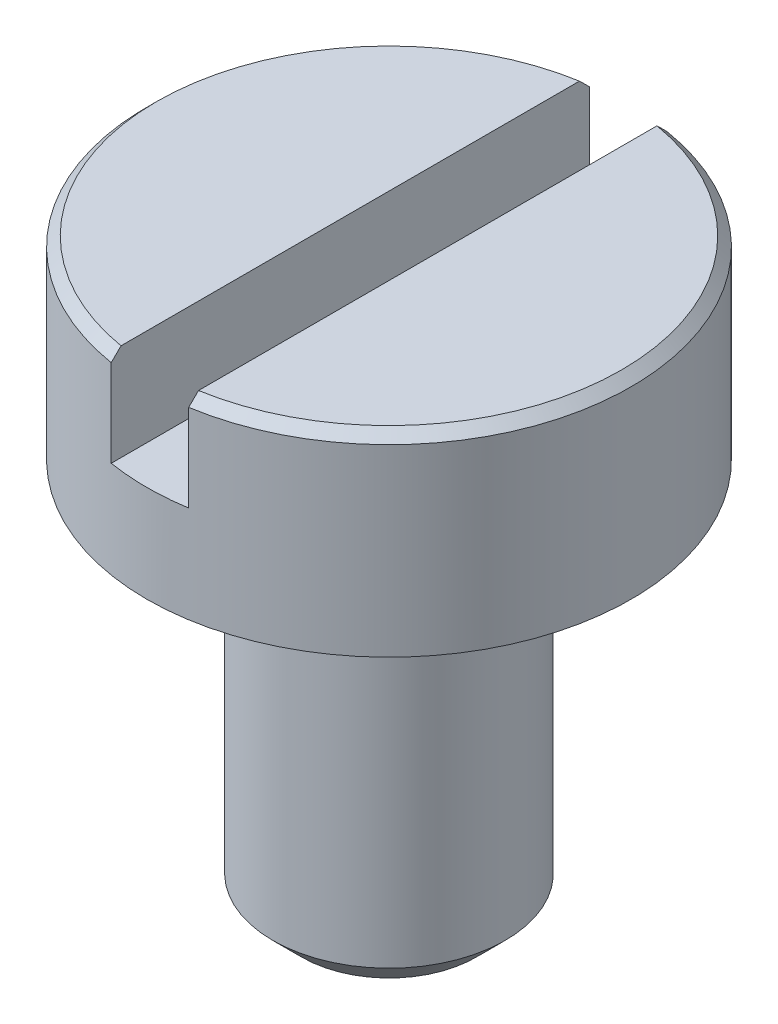
ISO-10303-21;
HEADER;
FILE_DESCRIPTION(('STEP AP214'),'2;1');
FILE_NAME('part.step','',(''),(''),'','','');
FILE_SCHEMA(('AUTOMOTIVE_DESIGN { 1 0 10303 214 1 1 1 1 }'));
ENDSEC;
DATA;
#1=APPLICATION_CONTEXT('core data for automotive mechanical design processes');
#2=APPLICATION_PROTOCOL_DEFINITION('international standard','automotive_design',2000,#1);
#3=PRODUCT_CONTEXT('',#1,'mechanical');
#4=PRODUCT('Part','Part','',(#3));
#5=PRODUCT_RELATED_PRODUCT_CATEGORY('part','',(#4));
#6=PRODUCT_DEFINITION_FORMATION('','',#4);
#7=PRODUCT_DEFINITION_CONTEXT('part definition',#1,'design');
#8=PRODUCT_DEFINITION('design','',#6,#7);
#9=PRODUCT_DEFINITION_SHAPE('','',#8);
#10=(LENGTH_UNIT() NAMED_UNIT(*) SI_UNIT(.MILLI.,.METRE.));
#11=(NAMED_UNIT(*) PLANE_ANGLE_UNIT() SI_UNIT($,.RADIAN.));
#12=(NAMED_UNIT(*) SI_UNIT($,.STERADIAN.) SOLID_ANGLE_UNIT());
#13=UNCERTAINTY_MEASURE_WITH_UNIT(LENGTH_MEASURE(1.E-05),#10,'distance_accuracy_value','');
#14=(GEOMETRIC_REPRESENTATION_CONTEXT(3) GLOBAL_UNCERTAINTY_ASSIGNED_CONTEXT((#13)) GLOBAL_UNIT_ASSIGNED_CONTEXT((#10,
#11,#12)) REPRESENTATION_CONTEXT('',''));
#15=CARTESIAN_POINT('',(0.,0.,0.));
#16=DIRECTION('',(0.,0.,1.));
#17=DIRECTION('',(1.,0.,0.));
#18=AXIS2_PLACEMENT_3D('',#15,#16,#17);
#19=CARTESIAN_POINT('',(0.,1.,0.));
#20=DIRECTION('',(0.,1.,0.));
#21=DIRECTION('',(0.,0.,1.));
#22=AXIS2_PLACEMENT_3D('',#19,#20,#21);
#23=PLANE('',#22);
#24=DIRECTION('',(0.,0.,1.));
#25=VECTOR('',#24,1.);
#26=CARTESIAN_POINT('',(0.199999999999993,1.00000000000684,-1.25));
#27=LINE('',#26,#25);
#28=CARTESIAN_POINT('',(0.199999999999993,1.00000000005478,-1.18321595656436));
#29=VERTEX_POINT('',#28);
#30=CARTESIAN_POINT('',(0.199999999999993,1.00000000005478,1.18321595656436));
#31=VERTEX_POINT('',#30);
#32=EDGE_CURVE('E103',#29,#31,#27,.T.);
#33=ORIENTED_EDGE('',*,*,#32,.T.);
#34=CARTESIAN_POINT('',(0.,1.,0.));
#35=DIRECTION('',(0.,1.,0.));
#36=DIRECTION('',(0.,0.,1.));
#37=AXIS2_PLACEMENT_3D('',#34,#35,#36);
#38=CIRCLE('',#37,1.2);
#39=EDGE_CURVE('E106',#31,#29,#38,.T.);
#40=ORIENTED_EDGE('',*,*,#39,.T.);
#41=EDGE_LOOP('',(#33,#40));
#42=FACE_BOUND('',#41,.T.);
#43=ADVANCED_FACE('F34',(#42),#23,.T.);
#44=CARTESIAN_POINT('',(0.,1.,0.));
#45=DIRECTION('',(0.,-1.,0.));
#46=DIRECTION('',(0.,0.,-1.));
#47=AXIS2_PLACEMENT_3D('',#44,#45,#46);
#48=CONICAL_SURFACE('',#47,1.2,0.785398163397448);
#49=CARTESIAN_POINT('',(0.200000000010298,-0.550499970006001,2.74321892764666));
#50=CARTESIAN_POINT('',(0.200000000009665,-0.455213162765805,2.64767704238669));
#51=CARTESIAN_POINT('',(0.200000000009032,-0.359937513568398,2.55212401485437));
#52=CARTESIAN_POINT('',(0.200000000007765,-0.169420508068208,2.36097790814471));
#53=CARTESIAN_POINT('',(0.200000000007132,-0.0741791529132254,2.26538482782341));
#54=CARTESIAN_POINT('',(0.200000000005866,0.116319695149603,2.07407816347689));
#55=CARTESIAN_POINT('',(0.200000000005233,0.211577150646349,1.97836454219651));
#56=CARTESIAN_POINT('',(0.200000000003967,0.402009738308947,1.78686111472761));
#57=CARTESIAN_POINT('',(0.200000000003335,0.497184872861133,1.69107131091329));
#58=CARTESIAN_POINT('',(0.200000000002077,0.686387712764911,1.50038687319824));
#59=CARTESIAN_POINT('',(0.200000000001452,0.780416807179608,1.40549361734106));
#60=CARTESIAN_POINT('',(0.200000000000204,0.968262322845297,1.21547993448714));
#61=CARTESIAN_POINT('',(0.19999999999958,1.06207872475645,1.12035948832932));
#62=CARTESIAN_POINT('',(0.199999999998648,1.20243119123835,0.977355461480635));
#63=CARTESIAN_POINT('',(0.199999999998337,1.24914288797131,0.92964429774466));
#64=CARTESIAN_POINT('',(0.199999999997717,1.342382748914,0.834039211920032));
#65=CARTESIAN_POINT('',(0.199999999997408,1.38891090664783,0.78614528349805));
#66=CARTESIAN_POINT('',(0.199999999996792,1.48164699901658,0.690063753271459));
#67=CARTESIAN_POINT('',(0.199999999996485,1.52785498423156,0.641876200222877));
#68=CARTESIAN_POINT('',(0.199999999995874,1.61970773528706,0.544967994388368));
#69=CARTESIAN_POINT('',(0.199999999995571,1.66535254461866,0.496247383322888));
#70=CARTESIAN_POINT('',(0.19999999999519,1.72266782210322,0.433444864485154));
#71=CARTESIAN_POINT('',(0.199999999995108,1.73493377902235,0.419907687196446));
#72=CARTESIAN_POINT('',(0.199999999994946,1.75933321361395,0.392712938429288));
#73=CARTESIAN_POINT('',(0.199999999994866,1.77146668409027,0.379055360483244));
#74=CARTESIAN_POINT('',(0.199999999994625,1.80767513658574,0.337781215529016));
#75=CARTESIAN_POINT('',(0.199999999994467,1.83149053909231,0.30993652805277));
#76=CARTESIAN_POINT('',(0.199999999994174,1.87559765273905,0.255861694889703));
#77=CARTESIAN_POINT('',(0.199999999994038,1.89600843610785,0.229732167370204));
#78=CARTESIAN_POINT('',(0.199999999993846,1.92480518477765,0.189258584223207));
#79=CARTESIAN_POINT('',(0.199999999993785,1.9340943798822,0.175565259028333));
#80=CARTESIAN_POINT('',(0.199999999993668,1.9516916832863,0.147569344113758));
#81=CARTESIAN_POINT('',(0.199999999993613,1.96000099641305,0.133267532657592));
#82=CARTESIAN_POINT('',(0.19999999999352,1.97397551284485,0.105858050019861));
#83=CARTESIAN_POINT('',(0.199999999993481,1.97984745678225,0.0928587110628561));
#84=CARTESIAN_POINT('',(0.199999999993415,1.98969907940147,0.066170201574711));
#85=CARTESIAN_POINT('',(0.199999999993389,1.99368518535234,0.0524835525761371));
#86=CARTESIAN_POINT('',(0.199999999993357,1.99850989657598,0.0269560064403988));
#87=CARTESIAN_POINT('',(0.199999999993348,1.99976945470937,0.0151985688412223));
#88=CARTESIAN_POINT('',(0.199999999993346,2.00017180433811,-0.00834316833392509));
#89=CARTESIAN_POINT('',(0.199999999993351,1.99931663500473,-0.0201274310939939));
#90=CARTESIAN_POINT('',(0.199999999993379,1.99516364544347,-0.0466323597923996));
#91=CARTESIAN_POINT('',(0.199999999993405,1.99124933098079,-0.0612520830452911));
#92=CARTESIAN_POINT('',(0.199999999993472,1.98120047529599,-0.0897419346987584));
#93=CARTESIAN_POINT('',(0.199999999993513,1.97505325106898,-0.103607250099817));
#94=CARTESIAN_POINT('',(0.199999999993634,1.95683264699946,-0.139694012078269));
#95=CARTESIAN_POINT('',(0.199999999993722,1.94354967224241,-0.161283559963001));
#96=CARTESIAN_POINT('',(0.19999999999391,1.91522821538713,-0.203300232270671));
#97=CARTESIAN_POINT('',(0.19999999999401,1.90018421605983,-0.223723388111887));
#98=CARTESIAN_POINT('',(0.199999999994217,1.86906691387832,-0.26396927487595));
#99=CARTESIAN_POINT('',(0.199999999994324,1.85298784008983,-0.283787530921938));
#100=CARTESIAN_POINT('',(0.199999999994541,1.82030678870662,-0.32292550376644));
#101=CARTESIAN_POINT('',(0.199999999994651,1.8037057208783,-0.342245991604889));
#102=CARTESIAN_POINT('',(0.199999999994982,1.75391150009937,-0.399168778579236));
#103=CARTESIAN_POINT('',(0.199999999995206,1.72023024763238,-0.436342661533494));
#104=CARTESIAN_POINT('',(0.199999999995658,1.6522499386492,-0.510122851915469));
#105=CARTESIAN_POINT('',(0.199999999995886,1.61795079363666,-0.546729076621811));
#106=CARTESIAN_POINT('',(0.199999999996574,1.51448679985957,-0.656131274344182));
#107=CARTESIAN_POINT('',(0.199999999997037,1.44481402863574,-0.728446418707842));
#108=CARTESIAN_POINT('',(0.199999999997963,1.30541653822855,-0.872097092354965));
#109=CARTESIAN_POINT('',(0.199999999998427,1.23569520003273,-0.943435937131604));
#110=CARTESIAN_POINT('',(0.199999999999355,1.09600243752921,-1.08581877001234));
#111=CARTESIAN_POINT('',(0.19999999999982,1.02603111182559,-1.15686285464373));
#112=CARTESIAN_POINT('',(0.200000000001113,0.831455984261945,-1.35400414768177));
#113=CARTESIAN_POINT('',(0.200000000001942,0.706690384452053,-1.47994133014952));
#114=CARTESIAN_POINT('',(0.200000000003602,0.456929969058611,-1.73162420941898));
#115=CARTESIAN_POINT('',(0.200000000004433,0.331935122936034,-1.85736987589489));
#116=CARTESIAN_POINT('',(0.200000000006103,0.080731397957399,-2.10984934347292));
#117=CARTESIAN_POINT('',(0.200000000006942,-0.0454785039857599,-2.23658212628326));
#118=CARTESIAN_POINT('',(0.20000000000862,-0.29795382350111,-2.48995468736278));
#119=CARTESIAN_POINT('',(0.200000000009459,-0.424219229972871,-2.61659447669181));
#120=CARTESIAN_POINT('',(0.200000000010298,-0.550499970006001,-2.74321892764666));
#121=B_SPLINE_CURVE_WITH_KNOTS('',3,(#49,#50,#51,#52,#53,#54,#55,#56,#57,#58,#59,#60,#61,#62,
#63,#64,#65,#66,#67,#68,#69,#70,#71,#72,#73,#74,#75,#76,#77,#78,#79,#80,#81,#82,#83,#84,#85,#86,
#87,#88,#89,#90,#91,#92,#93,#94,#95,#96,#97,#98,#99,#100,#101,#102,#103,#104,#105,#106,#107,
#108,#109,#110,#111,#112,#113,#114,#115,#116,#117,#118,#119,#120),.UNSPECIFIED.,.F.,.F.,(4,2,2,
2,2,2,2,2,2,2,2,2,2,2,2,2,2,2,2,2,2,2,2,2,2,2,2,2,2,2,2,2,2,2,2,4),(0.,0.404809164286615,
0.809630808758622,1.21474277533651,1.6198425760488,2.02061153496142,2.42141558044229,
2.62172776073857,2.82204694663977,3.02233373006624,3.22260494836592,3.27740738256671,
3.33221277876298,3.44212264151891,3.54151074286494,3.59112809829427,3.64068379548059,
3.68338714840298,3.72594389319426,3.76124040238462,3.79650288943392,3.84163164164153,
3.88702084101427,3.96284904572666,4.03892151800065,4.11546271191564,4.1918771876916,
4.34234648859536,4.49283751423309,4.7940806985343,5.09333469055351,5.3924814125276,
5.9243077123752,6.45621092303401,6.99278449743514,7.52927796907593),.UNSPECIFIED.);
#122=CARTESIAN_POINT('',(0.200000000000325,0.949999999999998,1.23389626792525));
#123=VERTEX_POINT('',#122);
#124=EDGE_CURVE('E173',#123,#31,#121,.T.);
#125=ORIENTED_EDGE('',*,*,#124,.F.);
#126=CARTESIAN_POINT('',(0.,0.949999999999998,0.));
#127=DIRECTION('',(0.,1.,0.));
#128=DIRECTION('',(0.,0.,1.));
#129=AXIS2_PLACEMENT_3D('',#126,#127,#128);
#130=CIRCLE('',#129,1.25);
#131=CARTESIAN_POINT('',(0.200000000000325,0.949999999999999,-1.23389626792525));
#132=VERTEX_POINT('',#131);
#133=EDGE_CURVE('E110',#132,#123,#130,.F.);
#134=ORIENTED_EDGE('',*,*,#133,.F.);
#135=EDGE_CURVE('E95',#29,#132,#121,.T.);
#136=ORIENTED_EDGE('',*,*,#135,.F.);
#137=ORIENTED_EDGE('',*,*,#39,.F.);
#138=EDGE_LOOP('',(#125,#134,#136,#137));
#139=FACE_BOUND('',#138,.T.);
#140=ADVANCED_FACE('F157',(#139),#48,.T.);
#141=CARTESIAN_POINT('',(0.,1.,0.));
#142=DIRECTION('',(0.,-1.,0.));
#143=DIRECTION('',(0.,0.,-1.));
#144=AXIS2_PLACEMENT_3D('',#141,#142,#143);
#145=CYLINDRICAL_SURFACE('',#144,1.25);
#146=ORIENTED_EDGE('',*,*,#133,.T.);
#147=DIRECTION('',(0.,-1.,0.));
#148=VECTOR('',#147,1.);
#149=CARTESIAN_POINT('',(0.199999999999993,1.00000000000133,1.23389626792531));
#150=LINE('',#149,#148);
#151=CARTESIAN_POINT('',(0.200000000003316,0.499999999999877,1.23389626792477));
#152=VERTEX_POINT('',#151);
#153=EDGE_CURVE('E57',#123,#152,#150,.T.);
#154=ORIENTED_EDGE('',*,*,#153,.T.);
#155=CARTESIAN_POINT('',(0.,0.500000000008591,0.));
#156=DIRECTION('',(-4.3568122199521E-11,-1.,0.));
#157=DIRECTION('',(1.,-4.3568122199521E-11,0.));
#158=AXIS2_PLACEMENT_3D('',#155,#156,#157);
#159=CIRCLE('',#158,1.25);
#160=CARTESIAN_POINT('',(-0.20000000000332,0.499999999999877,1.23389626792531));
#161=VERTEX_POINT('',#160);
#162=EDGE_CURVE('E38',#152,#161,#159,.T.);
#163=ORIENTED_EDGE('',*,*,#162,.T.);
#164=DIRECTION('',(0.,-1.,0.));
#165=VECTOR('',#164,1.);
#166=CARTESIAN_POINT('',(-0.2,1.00000000000133,1.23389626792531));
#167=LINE('',#166,#165);
#168=CARTESIAN_POINT('',(-0.200000000000332,0.949999999999999,1.23389626792525));
#169=VERTEX_POINT('',#168);
#170=EDGE_CURVE('E177',#161,#169,#167,.F.);
#171=ORIENTED_EDGE('',*,*,#170,.T.);
#172=CARTESIAN_POINT('',(-0.200000000000332,0.949999999999998,-1.23389626792525));
#173=VERTEX_POINT('',#172);
#174=EDGE_CURVE('E118',#169,#173,#130,.F.);
#175=ORIENTED_EDGE('',*,*,#174,.T.);
#176=DIRECTION('',(0.,-1.,0.));
#177=VECTOR('',#176,1.);
#178=CARTESIAN_POINT('',(-0.2,1.00000000000133,-1.23389626792531));
#179=LINE('',#178,#177);
#180=CARTESIAN_POINT('',(-0.20000000000332,0.499999999999877,-1.23389626792531));
#181=VERTEX_POINT('',#180);
#182=EDGE_CURVE('E90',#173,#181,#179,.T.);
#183=ORIENTED_EDGE('',*,*,#182,.T.);
#184=CARTESIAN_POINT('',(0.200000000003316,0.499999999999877,-1.23389626792477));
#185=VERTEX_POINT('',#184);
#186=EDGE_CURVE('E11',#181,#185,#159,.T.);
#187=ORIENTED_EDGE('',*,*,#186,.T.);
#188=DIRECTION('',(0.,-1.,0.));
#189=VECTOR('',#188,1.);
#190=CARTESIAN_POINT('',(0.199999999999993,1.00000000000133,-1.23389626792531));
#191=LINE('',#190,#189);
#192=EDGE_CURVE('E182',#185,#132,#191,.F.);
#193=ORIENTED_EDGE('',*,*,#192,.T.);
#194=EDGE_LOOP('',(#146,#154,#163,#171,#175,#183,#187,#193));
#195=FACE_BOUND('',#194,.T.);
#196=CARTESIAN_POINT('',(0.,0.,0.));
#197=DIRECTION('',(0.,1.,0.));
#198=DIRECTION('',(0.,0.,1.));
#199=AXIS2_PLACEMENT_3D('',#196,#197,#198);
#200=CIRCLE('',#199,1.25);
#201=CARTESIAN_POINT('',(0.,0.,1.25));
#202=VERTEX_POINT('',#201);
#203=EDGE_CURVE('E107',#202,#202,#200,.T.);
#204=ORIENTED_EDGE('',*,*,#203,.T.);
#205=EDGE_LOOP('',(#204));
#206=FACE_BOUND('',#205,.T.);
#207=ADVANCED_FACE('F153',(#195,#206),#145,.T.);
#208=DIRECTION('',(0.,0.,1.));
#209=VECTOR('',#208,1.);
#210=CARTESIAN_POINT('',(-0.2,1.00000000000684,-1.25));
#211=LINE('',#210,#209);
#212=CARTESIAN_POINT('',(-0.2,1.00000000000684,-1.18321595661299));
#213=VERTEX_POINT('',#212);
#214=CARTESIAN_POINT('',(-0.200000000001139,1.,1.18321595661973));
#215=VERTEX_POINT('',#214);
#216=EDGE_CURVE('E49',#213,#215,#211,.T.);
#217=ORIENTED_EDGE('',*,*,#216,.F.);
#218=EDGE_CURVE('E101',#213,#215,#38,.T.);
#219=ORIENTED_EDGE('',*,*,#218,.T.);
#220=EDGE_LOOP('',(#217,#219));
#221=FACE_BOUND('',#220,.T.);
#222=ADVANCED_FACE('F100',(#221),#23,.T.);
#223=CARTESIAN_POINT('',(0.,0.,0.));
#224=DIRECTION('',(0.,1.,0.));
#225=DIRECTION('',(0.,0.,1.));
#226=AXIS2_PLACEMENT_3D('',#223,#224,#225);
#227=PLANE('',#226);
#228=CARTESIAN_POINT('',(0.,0.,0.));
#229=DIRECTION('',(0.,1.,0.));
#230=DIRECTION('',(0.,0.,1.));
#231=AXIS2_PLACEMENT_3D('',#228,#229,#230);
#232=CIRCLE('',#231,0.6);
#233=CARTESIAN_POINT('',(0.,0.,0.6));
#234=VERTEX_POINT('',#233);
#235=EDGE_CURVE('E112',#234,#234,#232,.T.);
#236=ORIENTED_EDGE('',*,*,#235,.T.);
#237=EDGE_LOOP('',(#236));
#238=FACE_BOUND('',#237,.T.);
#239=ORIENTED_EDGE('',*,*,#203,.F.);
#240=EDGE_LOOP('',(#239));
#241=FACE_BOUND('',#240,.T.);
#242=ADVANCED_FACE('F149',(#238,#241),#227,.F.);
#243=CARTESIAN_POINT('',(0.,-2.,0.));
#244=DIRECTION('',(0.,1.,0.));
#245=DIRECTION('',(0.,0.,1.));
#246=AXIS2_PLACEMENT_3D('',#243,#244,#245);
#247=CYLINDRICAL_SURFACE('',#246,0.6);
#248=CARTESIAN_POINT('',(0.,-1.85,0.));
#249=DIRECTION('',(0.,1.,0.));
#250=DIRECTION('',(0.,0.,1.));
#251=AXIS2_PLACEMENT_3D('',#248,#249,#250);
#252=CIRCLE('',#251,0.6);
#253=CARTESIAN_POINT('',(0.,-1.85,0.6));
#254=VERTEX_POINT('',#253);
#255=EDGE_CURVE('E119',#254,#254,#252,.T.);
#256=ORIENTED_EDGE('',*,*,#255,.T.);
#257=EDGE_LOOP('',(#256));
#258=FACE_BOUND('',#257,.T.);
#259=ORIENTED_EDGE('',*,*,#235,.F.);
#260=EDGE_LOOP('',(#259));
#261=FACE_BOUND('',#260,.T.);
#262=ADVANCED_FACE('F145',(#258,#261),#247,.T.);
#263=CARTESIAN_POINT('',(0.,-2.,0.));
#264=DIRECTION('',(0.,1.,0.));
#265=DIRECTION('',(0.,0.,1.));
#266=AXIS2_PLACEMENT_3D('',#263,#264,#265);
#267=PLANE('',#266);
#268=CARTESIAN_POINT('',(0.,-2.,0.));
#269=DIRECTION('',(0.,1.,0.));
#270=DIRECTION('',(0.,0.,1.));
#271=AXIS2_PLACEMENT_3D('',#268,#269,#270);
#272=CIRCLE('',#271,0.45);
#273=CARTESIAN_POINT('',(0.,-2.,0.45));
#274=VERTEX_POINT('',#273);
#275=EDGE_CURVE('E122',#274,#274,#272,.F.);
#276=ORIENTED_EDGE('',*,*,#275,.T.);
#277=EDGE_LOOP('',(#276));
#278=FACE_BOUND('',#277,.T.);
#279=ADVANCED_FACE('F142',(#278),#267,.F.);
#280=CARTESIAN_POINT('',(-0.200000000010294,-0.550499970006001,-2.74321892764666));
#281=CARTESIAN_POINT('',(-0.200000000009662,-0.455213162765805,-2.64767704238669));
#282=CARTESIAN_POINT('',(-0.200000000009029,-0.359937513568397,-2.55212401485437));
#283=CARTESIAN_POINT('',(-0.200000000007764,-0.169420508068206,-2.36097790814471));
#284=CARTESIAN_POINT('',(-0.200000000007132,-0.0741791529132225,-2.26538482782341));
#285=CARTESIAN_POINT('',(-0.200000000005867,0.116319695149608,-2.07407816347688));
#286=CARTESIAN_POINT('',(-0.200000000005235,0.211577150646354,-1.97836454219651));
#287=CARTESIAN_POINT('',(-0.20000000000397,0.402009738308954,-1.7868611147276));
#288=CARTESIAN_POINT('',(-0.200000000003338,0.49718487286114,-1.69107131091328));
#289=CARTESIAN_POINT('',(-0.200000000002082,0.686387712764918,-1.50038687319823));
#290=CARTESIAN_POINT('',(-0.200000000001458,0.780416807179614,-1.40549361734105));
#291=CARTESIAN_POINT('',(-0.200000000000211,0.968262322845301,-1.21547993448714));
#292=CARTESIAN_POINT('',(-0.199999999999588,1.06207872475645,-1.12035948832931));
#293=CARTESIAN_POINT('',(-0.199999999998656,1.20243119123835,-0.977355461480631));
#294=CARTESIAN_POINT('',(-0.199999999998346,1.24914288797131,-0.929644297744655));
#295=CARTESIAN_POINT('',(-0.199999999997727,1.342382748914,-0.834039211920028));
#296=CARTESIAN_POINT('',(-0.199999999997418,1.38891090664783,-0.786145283498046));
#297=CARTESIAN_POINT('',(-0.199999999996802,1.48164699901658,-0.690063753271456));
#298=CARTESIAN_POINT('',(-0.199999999996495,1.52785498423155,-0.641876200222875));
#299=CARTESIAN_POINT('',(-0.199999999995886,1.61970773528706,-0.544967994388366));
#300=CARTESIAN_POINT('',(-0.199999999995583,1.66535254461866,-0.496247383322886));
#301=CARTESIAN_POINT('',(-0.199999999995202,1.72266782210322,-0.433444864485151));
#302=CARTESIAN_POINT('',(-0.199999999995121,1.73493377902234,-0.419907687196444));
#303=CARTESIAN_POINT('',(-0.199999999994959,1.75933321361395,-0.392712938429285));
#304=CARTESIAN_POINT('',(-0.199999999994878,1.77146668409027,-0.379055360483241));
#305=CARTESIAN_POINT('',(-0.199999999994638,1.80767513658573,-0.337781215529013));
#306=CARTESIAN_POINT('',(-0.19999999999448,1.83149053909231,-0.309936528052767));
#307=CARTESIAN_POINT('',(-0.199999999994187,1.87559765273905,-0.255861694889696));
#308=CARTESIAN_POINT('',(-0.199999999994051,1.89600843610785,-0.229732167370194));
#309=CARTESIAN_POINT('',(-0.19999999999386,1.92480518477765,-0.189258584223192));
#310=CARTESIAN_POINT('',(-0.199999999993798,1.9340943798822,-0.175565259028317));
#311=CARTESIAN_POINT('',(-0.199999999993681,1.9516916832863,-0.147569344113737));
#312=CARTESIAN_POINT('',(-0.199999999993626,1.96000099641306,-0.133267532657569));
#313=CARTESIAN_POINT('',(-0.199999999993534,1.97397551284485,-0.105858050019835));
#314=CARTESIAN_POINT('',(-0.199999999993495,1.97984745678225,-0.0928587110628288));
#315=CARTESIAN_POINT('',(-0.199999999993429,1.98969907940147,-0.0661702015746811));
#316=CARTESIAN_POINT('',(-0.199999999993403,1.99368518535233,-0.052483552576106));
#317=CARTESIAN_POINT('',(-0.199999999993371,1.99850989657597,-0.026956006440365));
#318=CARTESIAN_POINT('',(-0.199999999993362,1.99976945470935,-0.0151985688411872));
#319=CARTESIAN_POINT('',(-0.19999999999336,2.00017180433809,0.0083431683339625));
#320=CARTESIAN_POINT('',(-0.199999999993365,1.99931663500471,0.0201274310940322));
#321=CARTESIAN_POINT('',(-0.199999999993393,1.99516364544345,0.0466323597924432));
#322=CARTESIAN_POINT('',(-0.199999999993419,1.99124933098076,0.061252083045339));
#323=CARTESIAN_POINT('',(-0.199999999993486,1.98120047529596,0.0897419346988145));
#324=CARTESIAN_POINT('',(-0.199999999993526,1.97505325106894,0.103607250099877));
#325=CARTESIAN_POINT('',(-0.199999999993647,1.9568326469994,0.13969401207835));
#326=CARTESIAN_POINT('',(-0.199999999993736,1.94354967224234,0.161283559963096));
#327=CARTESIAN_POINT('',(-0.199999999993924,1.91522821538703,0.203300232270797));
#328=CARTESIAN_POINT('',(-0.199999999994023,1.90018421605971,0.223723388112027));
#329=CARTESIAN_POINT('',(-0.19999999999423,1.86906691387818,0.263969274876119));
#330=CARTESIAN_POINT('',(-0.199999999994337,1.85298784008968,0.283787530922121));
#331=CARTESIAN_POINT('',(-0.199999999994554,1.82030678870643,0.322925503766652));
#332=CARTESIAN_POINT('',(-0.199999999994664,1.8037057208781,0.342245991605115));
#333=CARTESIAN_POINT('',(-0.199999999994995,1.75391150009912,0.399168778579503));
#334=CARTESIAN_POINT('',(-0.199999999995218,1.72023024763211,0.436342661533789));
#335=CARTESIAN_POINT('',(-0.19999999999567,1.65224993864887,0.51012285191582));
#336=CARTESIAN_POINT('',(-0.199999999995897,1.6179507936363,0.54672907662219));
#337=CARTESIAN_POINT('',(-0.199999999996584,1.51448679985913,0.656131274344646));
#338=CARTESIAN_POINT('',(-0.199999999997047,1.44481402863523,0.728446418708363));
#339=CARTESIAN_POINT('',(-0.199999999997972,1.30541653822794,0.872097092355598));
#340=CARTESIAN_POINT('',(-0.199999999998435,1.23569520003205,0.943435937132294));
#341=CARTESIAN_POINT('',(-0.199999999999363,1.09600243752842,1.08581877001314));
#342=CARTESIAN_POINT('',(-0.199999999999827,1.02603111182474,1.15686285464459));
#343=CARTESIAN_POINT('',(-0.200000000001119,0.831455984261112,1.35400414768261));
#344=CARTESIAN_POINT('',(-0.200000000001947,0.706690384451295,1.47994133015028));
#345=CARTESIAN_POINT('',(-0.200000000003606,0.456929969058,1.7316242094196));
#346=CARTESIAN_POINT('',(-0.200000000004435,0.331935122935497,1.85736987589543));
#347=CARTESIAN_POINT('',(-0.200000000006103,0.0807313979570138,2.10984934347331));
#348=CARTESIAN_POINT('',(-0.200000000006941,-0.0454785039860681,2.23658212628357));
#349=CARTESIAN_POINT('',(-0.200000000008617,-0.297953823501265,2.48995468736294));
#350=CARTESIAN_POINT('',(-0.200000000009456,-0.424219229972948,2.61659447669189));
#351=CARTESIAN_POINT('',(-0.200000000010294,-0.550499970006001,2.74321892764666));
#352=B_SPLINE_CURVE_WITH_KNOTS('',3,(#280,#281,#282,#283,#284,#285,#286,#287,#288,#289,#290,
#291,#292,#293,#294,#295,#296,#297,#298,#299,#300,#301,#302,#303,#304,#305,#306,#307,#308,#309,
#310,#311,#312,#313,#314,#315,#316,#317,#318,#319,#320,#321,#322,#323,#324,#325,#326,#327,#328,
#329,#330,#331,#332,#333,#334,#335,#336,#337,#338,#339,#340,#341,#342,#343,#344,#345,#346,#347,
#348,#349,#350,#351),.UNSPECIFIED.,.F.,.F.,(4,2,2,2,2,2,2,2,2,2,2,2,2,2,2,2,2,2,2,2,2,2,2,2,2,2,
2,2,2,2,2,2,2,2,2,4),(0.,0.404809164286618,0.809630808758628,1.21474277533652,1.61984257604881,
2.02061153496143,2.4214155804423,2.62172776073857,2.82204694663978,3.02233373006624,
3.22260494836592,3.27740738256671,3.33221277876299,3.44212264151891,3.54151074286495,
3.59112809829429,3.64068379548062,3.683387148403,3.72594389319428,3.76124040238465,
3.79650288943395,3.84163164164158,3.88702084101433,3.96284904572678,4.03892151800083,
4.11546271191589,4.19187718769191,4.34234648859579,4.49283751423363,4.79408069853509,
5.09333469055454,5.39248141252888,5.92430771237615,6.45621092303464,6.99278449743545,
7.52927796907592),.UNSPECIFIED.);
#353=EDGE_CURVE('E86',#173,#213,#352,.T.);
#354=ORIENTED_EDGE('',*,*,#353,.F.);
#355=ORIENTED_EDGE('',*,*,#174,.F.);
#356=EDGE_CURVE('E96',#215,#169,#352,.T.);
#357=ORIENTED_EDGE('',*,*,#356,.F.);
#358=ORIENTED_EDGE('',*,*,#218,.F.);
#359=EDGE_LOOP('',(#354,#355,#357,#358));
#360=FACE_BOUND('',#359,.T.);
#361=ADVANCED_FACE('F105',(#360),#48,.T.);
#362=CARTESIAN_POINT('',(0.,-1.85,0.));
#363=DIRECTION('',(0.,1.,0.));
#364=DIRECTION('',(0.,0.,1.));
#365=AXIS2_PLACEMENT_3D('',#362,#363,#364);
#366=CONICAL_SURFACE('',#365,0.6,0.785398163397451);
#367=ORIENTED_EDGE('',*,*,#275,.F.);
#368=EDGE_LOOP('',(#367));
#369=FACE_BOUND('',#368,.T.);
#370=ORIENTED_EDGE('',*,*,#255,.F.);
#371=EDGE_LOOP('',(#370));
#372=FACE_BOUND('',#371,.T.);
#373=ADVANCED_FACE('F36',(#369,#372),#366,.T.);
#374=CARTESIAN_POINT('',(0.200000000003316,0.499999999999877,-1.25));
#375=DIRECTION('',(-4.3568122199521E-11,-1.,0.));
#376=DIRECTION('',(1.,-4.3568122199521E-11,0.));
#377=AXIS2_PLACEMENT_3D('',#374,#375,#376);
#378=PLANE('',#377);
#379=DIRECTION('',(0.,0.,1.));
#380=VECTOR('',#379,1.);
#381=CARTESIAN_POINT('',(0.200000000003316,0.499999999999877,-1.25));
#382=LINE('',#381,#380);
#383=EDGE_CURVE('E181',#185,#152,#382,.T.);
#384=ORIENTED_EDGE('',*,*,#383,.F.);
#385=ORIENTED_EDGE('',*,*,#186,.F.);
#386=DIRECTION('',(0.,0.,1.));
#387=VECTOR('',#386,1.);
#388=CARTESIAN_POINT('',(-0.20000000000332,0.499999999999877,-1.25));
#389=LINE('',#388,#387);
#390=EDGE_CURVE('E102',#181,#161,#389,.T.);
#391=ORIENTED_EDGE('',*,*,#390,.T.);
#392=ORIENTED_EDGE('',*,*,#162,.F.);
#393=EDGE_LOOP('',(#384,#385,#391,#392));
#394=FACE_BOUND('',#393,.T.);
#395=ADVANCED_FACE('F138',(#394),#378,.F.);
#396=CARTESIAN_POINT('',(0.199999999999993,1.00000000000684,-1.25));
#397=DIRECTION('',(1.,6.64632194756952E-12,0.));
#398=DIRECTION('',(-6.64632194756952E-12,1.,0.));
#399=AXIS2_PLACEMENT_3D('',#396,#397,#398);
#400=PLANE('',#399);
#401=ORIENTED_EDGE('',*,*,#124,.T.);
#402=ORIENTED_EDGE('',*,*,#32,.F.);
#403=ORIENTED_EDGE('',*,*,#135,.T.);
#404=ORIENTED_EDGE('',*,*,#192,.F.);
#405=ORIENTED_EDGE('',*,*,#383,.T.);
#406=ORIENTED_EDGE('',*,*,#153,.F.);
#407=EDGE_LOOP('',(#401,#402,#403,#404,#405,#406));
#408=FACE_BOUND('',#407,.T.);
#409=ADVANCED_FACE('F137',(#408),#400,.F.);
#410=CARTESIAN_POINT('',(-0.2,1.00000000000684,-1.25));
#411=DIRECTION('',(-1.,6.63927463344846E-12,0.));
#412=DIRECTION('',(-6.63927463344846E-12,-1.,0.));
#413=AXIS2_PLACEMENT_3D('',#410,#411,#412);
#414=PLANE('',#413);
#415=ORIENTED_EDGE('',*,*,#353,.T.);
#416=ORIENTED_EDGE('',*,*,#216,.T.);
#417=ORIENTED_EDGE('',*,*,#356,.T.);
#418=ORIENTED_EDGE('',*,*,#170,.F.);
#419=ORIENTED_EDGE('',*,*,#390,.F.);
#420=ORIENTED_EDGE('',*,*,#182,.F.);
#421=EDGE_LOOP('',(#415,#416,#417,#418,#419,#420));
#422=FACE_BOUND('',#421,.T.);
#423=ADVANCED_FACE('F87',(#422),#414,.F.);
#424=CLOSED_SHELL('',(#43,#140,#207,#222,#242,#262,#279,#361,#373,#395,#409,#423));
#425=MANIFOLD_SOLID_BREP('B2',#424);
#426=ADVANCED_BREP_SHAPE_REPRESENTATION('',(#18,#425),#14);
#427=SHAPE_DEFINITION_REPRESENTATION(#9,#426);
ENDSEC;
END-ISO-10303-21;
